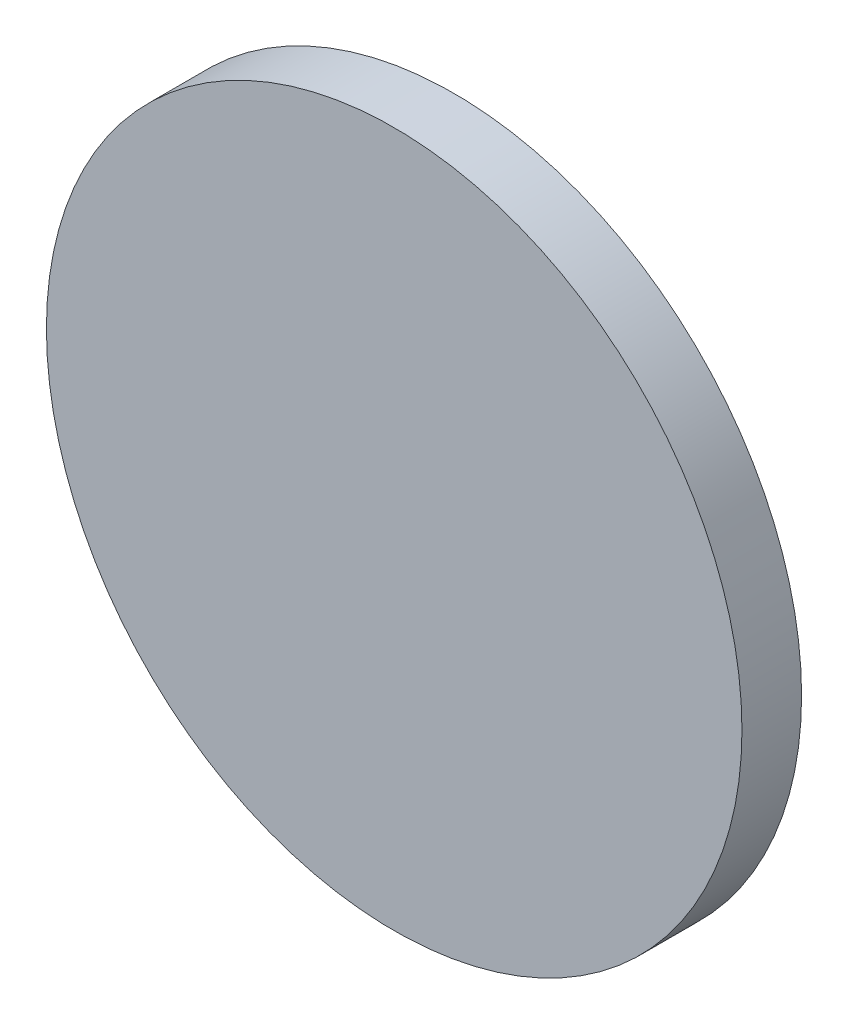
ISO-10303-21;
HEADER;
FILE_DESCRIPTION(('STEP AP214'),'2;1');
FILE_NAME('part.step','',(''),(''),'','','');
FILE_SCHEMA(('AUTOMOTIVE_DESIGN { 1 0 10303 214 1 1 1 1 }'));
ENDSEC;
DATA;
#1=APPLICATION_CONTEXT('core data for automotive mechanical design processes');
#2=APPLICATION_PROTOCOL_DEFINITION('international standard','automotive_design',2000,#1);
#3=PRODUCT_CONTEXT('',#1,'mechanical');
#4=PRODUCT('Part','Part','',(#3));
#5=PRODUCT_RELATED_PRODUCT_CATEGORY('part','',(#4));
#6=PRODUCT_DEFINITION_FORMATION('','',#4);
#7=PRODUCT_DEFINITION_CONTEXT('part definition',#1,'design');
#8=PRODUCT_DEFINITION('design','',#6,#7);
#9=PRODUCT_DEFINITION_SHAPE('','',#8);
#10=(LENGTH_UNIT() NAMED_UNIT(*) SI_UNIT(.MILLI.,.METRE.));
#11=(NAMED_UNIT(*) PLANE_ANGLE_UNIT() SI_UNIT($,.RADIAN.));
#12=(NAMED_UNIT(*) SI_UNIT($,.STERADIAN.) SOLID_ANGLE_UNIT());
#13=UNCERTAINTY_MEASURE_WITH_UNIT(LENGTH_MEASURE(1.E-05),#10,'distance_accuracy_value','');
#14=(GEOMETRIC_REPRESENTATION_CONTEXT(3) GLOBAL_UNCERTAINTY_ASSIGNED_CONTEXT((#13)) GLOBAL_UNIT_ASSIGNED_CONTEXT((#10,
#11,#12)) REPRESENTATION_CONTEXT('',''));
#15=CARTESIAN_POINT('',(0.,0.,0.));
#16=DIRECTION('',(0.,0.,1.));
#17=DIRECTION('',(1.,0.,0.));
#18=AXIS2_PLACEMENT_3D('',#15,#16,#17);
#19=CARTESIAN_POINT('',(5.80008,4.597,0.03429));
#20=DIRECTION('',(0.,0.,1.));
#21=DIRECTION('',(1.,0.,0.));
#22=AXIS2_PLACEMENT_3D('',#19,#20,#21);
#23=PLANE('',#22);
#24=CARTESIAN_POINT('',(5.80008,4.597,0.03429));
#25=DIRECTION('',(0.,0.,1.));
#26=DIRECTION('',(1.,0.,0.));
#27=AXIS2_PLACEMENT_3D('',#24,#25,#26);
#28=CIRCLE('',#27,0.200024667);
#29=CARTESIAN_POINT('',(6.000104667,4.597,0.03429));
#30=VERTEX_POINT('',#29);
#31=EDGE_CURVE('E18',#30,#30,#28,.F.);
#32=ORIENTED_EDGE('',*,*,#31,.F.);
#33=EDGE_LOOP('',(#32));
#34=FACE_BOUND('',#33,.T.);
#35=ADVANCED_FACE('F15',(#34),#23,.T.);
#36=CARTESIAN_POINT('',(5.80008,4.597,0.));
#37=DIRECTION('',(0.,0.,1.));
#38=DIRECTION('',(1.,0.,0.));
#39=AXIS2_PLACEMENT_3D('',#36,#37,#38);
#40=CYLINDRICAL_SURFACE('',#39,0.200024667);
#41=ORIENTED_EDGE('',*,*,#31,.T.);
#42=EDGE_LOOP('',(#41));
#43=FACE_BOUND('',#42,.T.);
#44=CARTESIAN_POINT('',(5.80008,4.597,0.));
#45=DIRECTION('',(0.,0.,1.));
#46=DIRECTION('',(1.,0.,0.));
#47=AXIS2_PLACEMENT_3D('',#44,#45,#46);
#48=CIRCLE('',#47,0.200024667);
#49=CARTESIAN_POINT('',(6.000104667,4.597,0.));
#50=VERTEX_POINT('',#49);
#51=EDGE_CURVE('E10',#50,#50,#48,.F.);
#52=ORIENTED_EDGE('',*,*,#51,.F.);
#53=EDGE_LOOP('',(#52));
#54=FACE_BOUND('',#53,.T.);
#55=ADVANCED_FACE('F27',(#43,#54),#40,.T.);
#56=CARTESIAN_POINT('',(5.80008,4.597,0.));
#57=DIRECTION('',(0.,0.,-1.));
#58=DIRECTION('',(-1.,0.,0.));
#59=AXIS2_PLACEMENT_3D('',#56,#57,#58);
#60=PLANE('',#59);
#61=ORIENTED_EDGE('',*,*,#51,.T.);
#62=EDGE_LOOP('',(#61));
#63=FACE_BOUND('',#62,.T.);
#64=ADVANCED_FACE('F35',(#63),#60,.T.);
#65=CLOSED_SHELL('',(#35,#55,#64));
#66=MANIFOLD_SOLID_BREP('B1',#65);
#67=ADVANCED_BREP_SHAPE_REPRESENTATION('',(#18,#66),#14);
#68=SHAPE_DEFINITION_REPRESENTATION(#9,#67);
ENDSEC;
END-ISO-10303-21;
